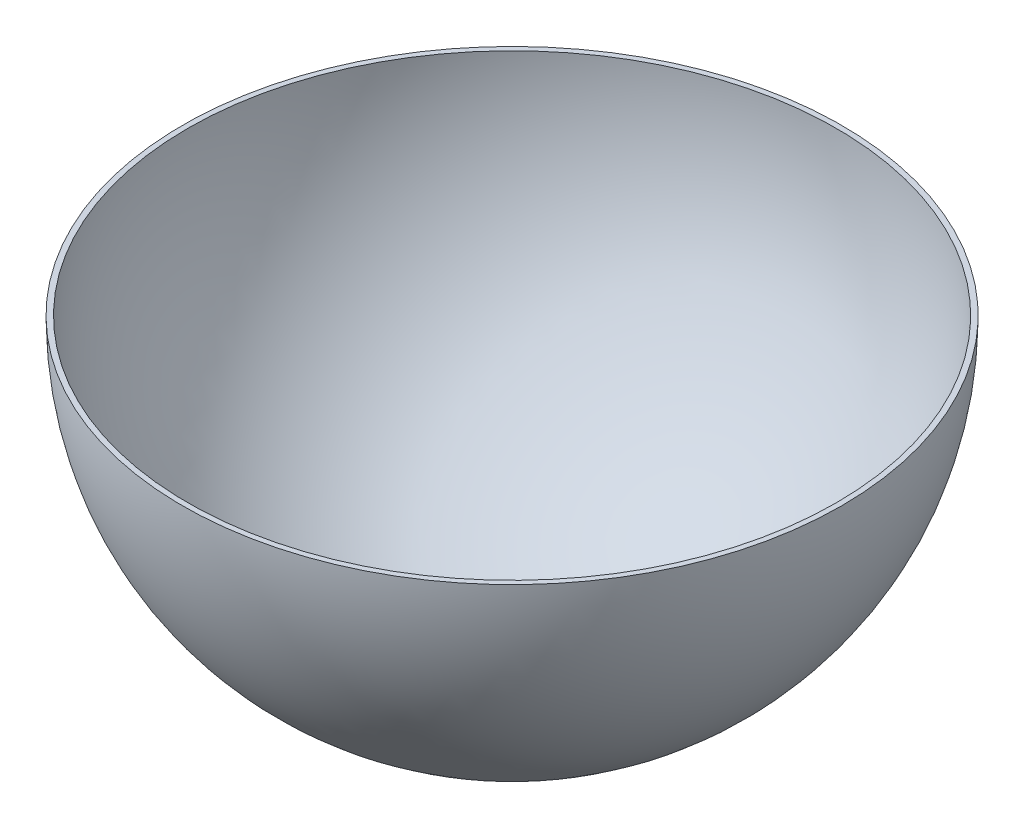
ISO-10303-21;
HEADER;
FILE_DESCRIPTION(('STEP AP214'),'2;1');
FILE_NAME('part.step','',(''),(''),'','','');
FILE_SCHEMA(('AUTOMOTIVE_DESIGN { 1 0 10303 214 1 1 1 1 }'));
ENDSEC;
DATA;
#1=APPLICATION_CONTEXT('core data for automotive mechanical design processes');
#2=APPLICATION_PROTOCOL_DEFINITION('international standard','automotive_design',2000,#1);
#3=PRODUCT_CONTEXT('',#1,'mechanical');
#4=PRODUCT('Part','Part','',(#3));
#5=PRODUCT_RELATED_PRODUCT_CATEGORY('part','',(#4));
#6=PRODUCT_DEFINITION_FORMATION('','',#4);
#7=PRODUCT_DEFINITION_CONTEXT('part definition',#1,'design');
#8=PRODUCT_DEFINITION('design','',#6,#7);
#9=PRODUCT_DEFINITION_SHAPE('','',#8);
#10=(LENGTH_UNIT() NAMED_UNIT(*) SI_UNIT(.MILLI.,.METRE.));
#11=(NAMED_UNIT(*) PLANE_ANGLE_UNIT() SI_UNIT($,.RADIAN.));
#12=(NAMED_UNIT(*) SI_UNIT($,.STERADIAN.) SOLID_ANGLE_UNIT());
#13=UNCERTAINTY_MEASURE_WITH_UNIT(LENGTH_MEASURE(1.E-05),#10,'distance_accuracy_value','');
#14=(GEOMETRIC_REPRESENTATION_CONTEXT(3) GLOBAL_UNCERTAINTY_ASSIGNED_CONTEXT((#13)) GLOBAL_UNIT_ASSIGNED_CONTEXT((#10,
#11,#12)) REPRESENTATION_CONTEXT('',''));
#15=CARTESIAN_POINT('',(0.,0.,0.));
#16=DIRECTION('',(0.,0.,1.));
#17=DIRECTION('',(1.,0.,0.));
#18=AXIS2_PLACEMENT_3D('',#15,#16,#17);
#19=CARTESIAN_POINT('',(0.,0.,0.));
#20=DIRECTION('',(-1.,0.,0.));
#21=DIRECTION('',(0.,0.,-1.));
#22=AXIS2_PLACEMENT_3D('',#19,#20,#21);
#23=SPHERICAL_SURFACE('',#22,123.);
#24=CARTESIAN_POINT('',(0.,0.,0.));
#25=DIRECTION('',(0.,1.,0.));
#26=DIRECTION('',(1.,0.,0.));
#27=AXIS2_PLACEMENT_3D('',#24,#25,#26);
#28=SPHERICAL_SURFACE('',#27,123.);
#29=CARTESIAN_POINT('',(0.,0.,0.));
#30=DIRECTION('',(0.,1.,0.));
#31=DIRECTION('',(1.,0.,0.));
#32=AXIS2_PLACEMENT_3D('',#29,#30,#31);
#33=CIRCLE('',#32,123.);
#34=CARTESIAN_POINT('',(123.,0.,0.));
#35=VERTEX_POINT('',#34);
#36=EDGE_CURVE('E41',#35,#35,#33,.T.);
#37=ORIENTED_EDGE('',*,*,#36,.T.);
#38=EDGE_LOOP('',(#37));
#39=FACE_BOUND('',#38,.T.);
#40=ADVANCED_FACE('F34',(#39),#28,.F.);
#41=CARTESIAN_POINT('',(0.,0.,0.));
#42=DIRECTION('',(-1.,0.,0.));
#43=DIRECTION('',(0.,0.,1.));
#44=AXIS2_PLACEMENT_3D('',#41,#42,#43);
#45=SPHERICAL_SURFACE('',#44,125.);
#46=CARTESIAN_POINT('',(0.,0.,0.));
#47=DIRECTION('',(0.,-1.,0.));
#48=DIRECTION('',(1.,0.,0.));
#49=AXIS2_PLACEMENT_3D('',#46,#47,#48);
#50=SPHERICAL_SURFACE('',#49,125.);
#51=CARTESIAN_POINT('',(0.,0.,0.));
#52=DIRECTION('',(0.,-1.,0.));
#53=DIRECTION('',(1.,0.,0.));
#54=AXIS2_PLACEMENT_3D('',#51,#52,#53);
#55=CIRCLE('',#54,125.);
#56=CARTESIAN_POINT('',(125.,0.,0.));
#57=VERTEX_POINT('',#56);
#58=EDGE_CURVE('E10',#57,#57,#55,.T.);
#59=ORIENTED_EDGE('',*,*,#58,.T.);
#60=EDGE_LOOP('',(#59));
#61=FACE_BOUND('',#60,.T.);
#62=ADVANCED_FACE('F36',(#61),#50,.T.);
#63=CARTESIAN_POINT('',(0.,0.,0.));
#64=DIRECTION('',(0.,-1.,0.));
#65=DIRECTION('',(1.,0.,0.));
#66=AXIS2_PLACEMENT_3D('',#63,#64,#65);
#67=PLANE('',#66);
#68=ORIENTED_EDGE('',*,*,#58,.F.);
#69=EDGE_LOOP('',(#68));
#70=FACE_BOUND('',#69,.T.);
#71=ORIENTED_EDGE('',*,*,#36,.F.);
#72=EDGE_LOOP('',(#71));
#73=FACE_BOUND('',#72,.T.);
#74=ADVANCED_FACE('F48',(#70,#73),#67,.F.);
#75=CLOSED_SHELL('',(#40,#62,#74));
#76=MANIFOLD_SOLID_BREP('B2',#75);
#77=ADVANCED_BREP_SHAPE_REPRESENTATION('',(#18,#76),#14);
#78=SHAPE_DEFINITION_REPRESENTATION(#9,#77);
ENDSEC;
END-ISO-10303-21;
